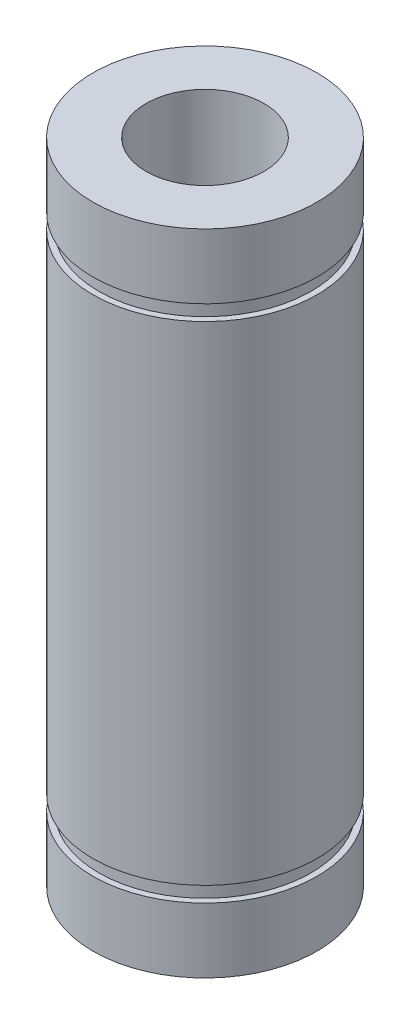
ISO-10303-21;
HEADER;
FILE_DESCRIPTION(('STEP AP214'),'2;1');
FILE_NAME('part.step','',(''),(''),'','','');
FILE_SCHEMA(('AUTOMOTIVE_DESIGN { 1 0 10303 214 1 1 1 1 }'));
ENDSEC;
DATA;
#1=APPLICATION_CONTEXT('core data for automotive mechanical design processes');
#2=APPLICATION_PROTOCOL_DEFINITION('international standard','automotive_design',2000,#1);
#3=PRODUCT_CONTEXT('',#1,'mechanical');
#4=PRODUCT('Part','Part','',(#3));
#5=PRODUCT_RELATED_PRODUCT_CATEGORY('part','',(#4));
#6=PRODUCT_DEFINITION_FORMATION('','',#4);
#7=PRODUCT_DEFINITION_CONTEXT('part definition',#1,'design');
#8=PRODUCT_DEFINITION('design','',#6,#7);
#9=PRODUCT_DEFINITION_SHAPE('','',#8);
#10=(LENGTH_UNIT() NAMED_UNIT(*) SI_UNIT(.MILLI.,.METRE.));
#11=(NAMED_UNIT(*) PLANE_ANGLE_UNIT() SI_UNIT($,.RADIAN.));
#12=(NAMED_UNIT(*) SI_UNIT($,.STERADIAN.) SOLID_ANGLE_UNIT());
#13=UNCERTAINTY_MEASURE_WITH_UNIT(LENGTH_MEASURE(1.E-05),#10,'distance_accuracy_value','');
#14=(GEOMETRIC_REPRESENTATION_CONTEXT(3) GLOBAL_UNCERTAINTY_ASSIGNED_CONTEXT((#13)) GLOBAL_UNIT_ASSIGNED_CONTEXT((#10,
#11,#12)) REPRESENTATION_CONTEXT('',''));
#15=CARTESIAN_POINT('',(0.,0.,0.));
#16=DIRECTION('',(0.,0.,1.));
#17=DIRECTION('',(1.,0.,0.));
#18=AXIS2_PLACEMENT_3D('',#15,#16,#17);
#19=CARTESIAN_POINT('',(0.,46.0446188340807,0.));
#20=DIRECTION('',(0.,1.,0.));
#21=DIRECTION('',(0.,0.,1.));
#22=AXIS2_PLACEMENT_3D('',#19,#20,#21);
#23=CYLINDRICAL_SURFACE('',#22,5.00000000000001);
#24=CARTESIAN_POINT('',(0.,-27.5,0.));
#25=DIRECTION('',(0.,1.,0.));
#26=DIRECTION('',(0.,0.,1.));
#27=AXIS2_PLACEMENT_3D('',#24,#25,#26);
#28=CIRCLE('',#27,5.00000000000001);
#29=CARTESIAN_POINT('',(0.,-27.5,5.00000000000001));
#30=VERTEX_POINT('',#29);
#31=EDGE_CURVE('E10',#30,#30,#28,.T.);
#32=ORIENTED_EDGE('',*,*,#31,.F.);
#33=EDGE_LOOP('',(#32));
#34=FACE_BOUND('',#33,.T.);
#35=CARTESIAN_POINT('',(0.,27.5,0.));
#36=DIRECTION('',(0.,1.,0.));
#37=DIRECTION('',(0.,0.,1.));
#38=AXIS2_PLACEMENT_3D('',#35,#36,#37);
#39=CIRCLE('',#38,5.00000000000001);
#40=CARTESIAN_POINT('',(0.,27.5,5.00000000000001));
#41=VERTEX_POINT('',#40);
#42=EDGE_CURVE('E71',#41,#41,#39,.T.);
#43=ORIENTED_EDGE('',*,*,#42,.T.);
#44=EDGE_LOOP('',(#43));
#45=FACE_BOUND('',#44,.T.);
#46=ADVANCED_FACE('F31',(#34,#45),#23,.F.);
#47=CARTESIAN_POINT('',(5.00000000000001,-27.5,0.));
#48=DIRECTION('',(0.,1.,0.));
#49=DIRECTION('',(0.,0.,1.));
#50=AXIS2_PLACEMENT_3D('',#47,#48,#49);
#51=PLANE('',#50);
#52=CARTESIAN_POINT('',(0.,-27.5,0.));
#53=DIRECTION('',(0.,1.,0.));
#54=DIRECTION('',(0.,0.,1.));
#55=AXIS2_PLACEMENT_3D('',#52,#53,#54);
#56=CIRCLE('',#55,9.50000000000001);
#57=CARTESIAN_POINT('',(0.,-27.5,9.50000000000001));
#58=VERTEX_POINT('',#57);
#59=EDGE_CURVE('E37',#58,#58,#56,.T.);
#60=ORIENTED_EDGE('',*,*,#59,.F.);
#61=EDGE_LOOP('',(#60));
#62=FACE_BOUND('',#61,.T.);
#63=ORIENTED_EDGE('',*,*,#31,.T.);
#64=EDGE_LOOP('',(#63));
#65=FACE_BOUND('',#64,.T.);
#66=ADVANCED_FACE('F132',(#62,#65),#51,.F.);
#67=CARTESIAN_POINT('',(0.,46.0446188340807,0.));
#68=DIRECTION('',(0.,1.,0.));
#69=DIRECTION('',(0.,0.,1.));
#70=AXIS2_PLACEMENT_3D('',#67,#68,#69);
#71=CYLINDRICAL_SURFACE('',#70,9.50000000000001);
#72=CARTESIAN_POINT('',(0.,-22.,0.));
#73=DIRECTION('',(0.,1.,0.));
#74=DIRECTION('',(0.,0.,1.));
#75=AXIS2_PLACEMENT_3D('',#72,#73,#74);
#76=CIRCLE('',#75,9.50000000000001);
#77=CARTESIAN_POINT('',(0.,-22.,9.50000000000001));
#78=VERTEX_POINT('',#77);
#79=EDGE_CURVE('E41',#78,#78,#76,.T.);
#80=ORIENTED_EDGE('',*,*,#79,.F.);
#81=EDGE_LOOP('',(#80));
#82=FACE_BOUND('',#81,.T.);
#83=ORIENTED_EDGE('',*,*,#59,.T.);
#84=EDGE_LOOP('',(#83));
#85=FACE_BOUND('',#84,.T.);
#86=ADVANCED_FACE('F127',(#82,#85),#71,.T.);
#87=CARTESIAN_POINT('',(9.50000000000001,-22.,0.));
#88=DIRECTION('',(0.,-1.,0.));
#89=DIRECTION('',(0.,0.,-1.));
#90=AXIS2_PLACEMENT_3D('',#87,#88,#89);
#91=PLANE('',#90);
#92=CARTESIAN_POINT('',(0.,-22.,0.));
#93=DIRECTION('',(0.,1.,0.));
#94=DIRECTION('',(0.,0.,1.));
#95=AXIS2_PLACEMENT_3D('',#92,#93,#94);
#96=CIRCLE('',#95,9.00000000000001);
#97=CARTESIAN_POINT('',(0.,-22.,9.00000000000001));
#98=VERTEX_POINT('',#97);
#99=EDGE_CURVE('E45',#98,#98,#96,.T.);
#100=ORIENTED_EDGE('',*,*,#99,.F.);
#101=EDGE_LOOP('',(#100));
#102=FACE_BOUND('',#101,.T.);
#103=ORIENTED_EDGE('',*,*,#79,.T.);
#104=EDGE_LOOP('',(#103));
#105=FACE_BOUND('',#104,.T.);
#106=ADVANCED_FACE('F121',(#102,#105),#91,.F.);
#107=CARTESIAN_POINT('',(0.,46.0446188340807,0.));
#108=DIRECTION('',(0.,1.,0.));
#109=DIRECTION('',(0.,0.,1.));
#110=AXIS2_PLACEMENT_3D('',#107,#108,#109);
#111=CYLINDRICAL_SURFACE('',#110,9.00000000000001);
#112=CARTESIAN_POINT('',(0.,-20.7,0.));
#113=DIRECTION('',(0.,1.,0.));
#114=DIRECTION('',(0.,0.,1.));
#115=AXIS2_PLACEMENT_3D('',#112,#113,#114);
#116=CIRCLE('',#115,9.00000000000001);
#117=CARTESIAN_POINT('',(0.,-20.7,9.00000000000001));
#118=VERTEX_POINT('',#117);
#119=EDGE_CURVE('E50',#118,#118,#116,.T.);
#120=ORIENTED_EDGE('',*,*,#119,.F.);
#121=EDGE_LOOP('',(#120));
#122=FACE_BOUND('',#121,.T.);
#123=ORIENTED_EDGE('',*,*,#99,.T.);
#124=EDGE_LOOP('',(#123));
#125=FACE_BOUND('',#124,.T.);
#126=ADVANCED_FACE('F115',(#122,#125),#111,.T.);
#127=CARTESIAN_POINT('',(9.50000000000001,-20.7,0.));
#128=DIRECTION('',(0.,1.,0.));
#129=DIRECTION('',(0.,0.,1.));
#130=AXIS2_PLACEMENT_3D('',#127,#128,#129);
#131=PLANE('',#130);
#132=CARTESIAN_POINT('',(0.,-20.7,0.));
#133=DIRECTION('',(0.,1.,0.));
#134=DIRECTION('',(0.,0.,1.));
#135=AXIS2_PLACEMENT_3D('',#132,#133,#134);
#136=CIRCLE('',#135,9.50000000000001);
#137=CARTESIAN_POINT('',(0.,-20.7,9.50000000000001));
#138=VERTEX_POINT('',#137);
#139=EDGE_CURVE('E53',#138,#138,#136,.T.);
#140=ORIENTED_EDGE('',*,*,#139,.F.);
#141=EDGE_LOOP('',(#140));
#142=FACE_BOUND('',#141,.T.);
#143=ORIENTED_EDGE('',*,*,#119,.T.);
#144=EDGE_LOOP('',(#143));
#145=FACE_BOUND('',#144,.T.);
#146=ADVANCED_FACE('F109',(#142,#145),#131,.F.);
#147=CARTESIAN_POINT('',(0.,46.0446188340807,0.));
#148=DIRECTION('',(0.,1.,0.));
#149=DIRECTION('',(0.,0.,1.));
#150=AXIS2_PLACEMENT_3D('',#147,#148,#149);
#151=CYLINDRICAL_SURFACE('',#150,9.50000000000001);
#152=CARTESIAN_POINT('',(0.,20.7,0.));
#153=DIRECTION('',(0.,1.,0.));
#154=DIRECTION('',(0.,0.,1.));
#155=AXIS2_PLACEMENT_3D('',#152,#153,#154);
#156=CIRCLE('',#155,9.5);
#157=CARTESIAN_POINT('',(0.,20.7,9.5));
#158=VERTEX_POINT('',#157);
#159=EDGE_CURVE('E56',#158,#158,#156,.T.);
#160=ORIENTED_EDGE('',*,*,#159,.F.);
#161=EDGE_LOOP('',(#160));
#162=FACE_BOUND('',#161,.T.);
#163=ORIENTED_EDGE('',*,*,#139,.T.);
#164=EDGE_LOOP('',(#163));
#165=FACE_BOUND('',#164,.T.);
#166=ADVANCED_FACE('F103',(#162,#165),#151,.T.);
#167=CARTESIAN_POINT('',(9.5,20.7,0.));
#168=DIRECTION('',(0.,-1.,0.));
#169=DIRECTION('',(0.,0.,-1.));
#170=AXIS2_PLACEMENT_3D('',#167,#168,#169);
#171=PLANE('',#170);
#172=CARTESIAN_POINT('',(0.,20.7,0.));
#173=DIRECTION('',(0.,1.,0.));
#174=DIRECTION('',(0.,0.,1.));
#175=AXIS2_PLACEMENT_3D('',#172,#173,#174);
#176=CIRCLE('',#175,9.);
#177=CARTESIAN_POINT('',(0.,20.7,9.));
#178=VERTEX_POINT('',#177);
#179=EDGE_CURVE('E59',#178,#178,#176,.T.);
#180=ORIENTED_EDGE('',*,*,#179,.F.);
#181=EDGE_LOOP('',(#180));
#182=FACE_BOUND('',#181,.T.);
#183=ORIENTED_EDGE('',*,*,#159,.T.);
#184=EDGE_LOOP('',(#183));
#185=FACE_BOUND('',#184,.T.);
#186=ADVANCED_FACE('F97',(#182,#185),#171,.F.);
#187=CARTESIAN_POINT('',(0.,46.0446188340807,0.));
#188=DIRECTION('',(0.,1.,0.));
#189=DIRECTION('',(0.,0.,1.));
#190=AXIS2_PLACEMENT_3D('',#187,#188,#189);
#191=CYLINDRICAL_SURFACE('',#190,9.00000000000001);
#192=CARTESIAN_POINT('',(0.,22.,0.));
#193=DIRECTION('',(0.,1.,0.));
#194=DIRECTION('',(0.,0.,1.));
#195=AXIS2_PLACEMENT_3D('',#192,#193,#194);
#196=CIRCLE('',#195,9.00000000000001);
#197=CARTESIAN_POINT('',(0.,22.,9.00000000000001));
#198=VERTEX_POINT('',#197);
#199=EDGE_CURVE('E62',#198,#198,#196,.T.);
#200=ORIENTED_EDGE('',*,*,#199,.F.);
#201=EDGE_LOOP('',(#200));
#202=FACE_BOUND('',#201,.T.);
#203=ORIENTED_EDGE('',*,*,#179,.T.);
#204=EDGE_LOOP('',(#203));
#205=FACE_BOUND('',#204,.T.);
#206=ADVANCED_FACE('F91',(#202,#205),#191,.T.);
#207=CARTESIAN_POINT('',(9.50000000000001,22.,0.));
#208=DIRECTION('',(0.,1.,0.));
#209=DIRECTION('',(0.,0.,1.));
#210=AXIS2_PLACEMENT_3D('',#207,#208,#209);
#211=PLANE('',#210);
#212=CARTESIAN_POINT('',(0.,22.,0.));
#213=DIRECTION('',(0.,1.,0.));
#214=DIRECTION('',(0.,0.,1.));
#215=AXIS2_PLACEMENT_3D('',#212,#213,#214);
#216=CIRCLE('',#215,9.50000000000001);
#217=CARTESIAN_POINT('',(0.,22.,9.50000000000001));
#218=VERTEX_POINT('',#217);
#219=EDGE_CURVE('E65',#218,#218,#216,.T.);
#220=ORIENTED_EDGE('',*,*,#219,.F.);
#221=EDGE_LOOP('',(#220));
#222=FACE_BOUND('',#221,.T.);
#223=ORIENTED_EDGE('',*,*,#199,.T.);
#224=EDGE_LOOP('',(#223));
#225=FACE_BOUND('',#224,.T.);
#226=ADVANCED_FACE('F85',(#222,#225),#211,.F.);
#227=CARTESIAN_POINT('',(0.,46.0446188340807,0.));
#228=DIRECTION('',(0.,1.,0.));
#229=DIRECTION('',(0.,0.,1.));
#230=AXIS2_PLACEMENT_3D('',#227,#228,#229);
#231=CYLINDRICAL_SURFACE('',#230,9.50000000000001);
#232=CARTESIAN_POINT('',(0.,27.5,0.));
#233=DIRECTION('',(0.,1.,0.));
#234=DIRECTION('',(0.,0.,1.));
#235=AXIS2_PLACEMENT_3D('',#232,#233,#234);
#236=CIRCLE('',#235,9.50000000000001);
#237=CARTESIAN_POINT('',(0.,27.5,9.50000000000001));
#238=VERTEX_POINT('',#237);
#239=EDGE_CURVE('E68',#238,#238,#236,.T.);
#240=ORIENTED_EDGE('',*,*,#239,.F.);
#241=EDGE_LOOP('',(#240));
#242=FACE_BOUND('',#241,.T.);
#243=ORIENTED_EDGE('',*,*,#219,.T.);
#244=EDGE_LOOP('',(#243));
#245=FACE_BOUND('',#244,.T.);
#246=ADVANCED_FACE('F79',(#242,#245),#231,.T.);
#247=CARTESIAN_POINT('',(5.00000000000001,27.5,0.));
#248=DIRECTION('',(0.,-1.,0.));
#249=DIRECTION('',(0.,0.,-1.));
#250=AXIS2_PLACEMENT_3D('',#247,#248,#249);
#251=PLANE('',#250);
#252=ORIENTED_EDGE('',*,*,#42,.F.);
#253=EDGE_LOOP('',(#252));
#254=FACE_BOUND('',#253,.T.);
#255=ORIENTED_EDGE('',*,*,#239,.T.);
#256=EDGE_LOOP('',(#255));
#257=FACE_BOUND('',#256,.T.);
#258=ADVANCED_FACE('F76',(#254,#257),#251,.F.);
#259=CLOSED_SHELL('',(#46,#66,#86,#106,#126,#146,#166,#186,#206,#226,#246,#258));
#260=MANIFOLD_SOLID_BREP('B2',#259);
#261=ADVANCED_BREP_SHAPE_REPRESENTATION('',(#18,#260),#14);
#262=SHAPE_DEFINITION_REPRESENTATION(#9,#261);
ENDSEC;
END-ISO-10303-21;
